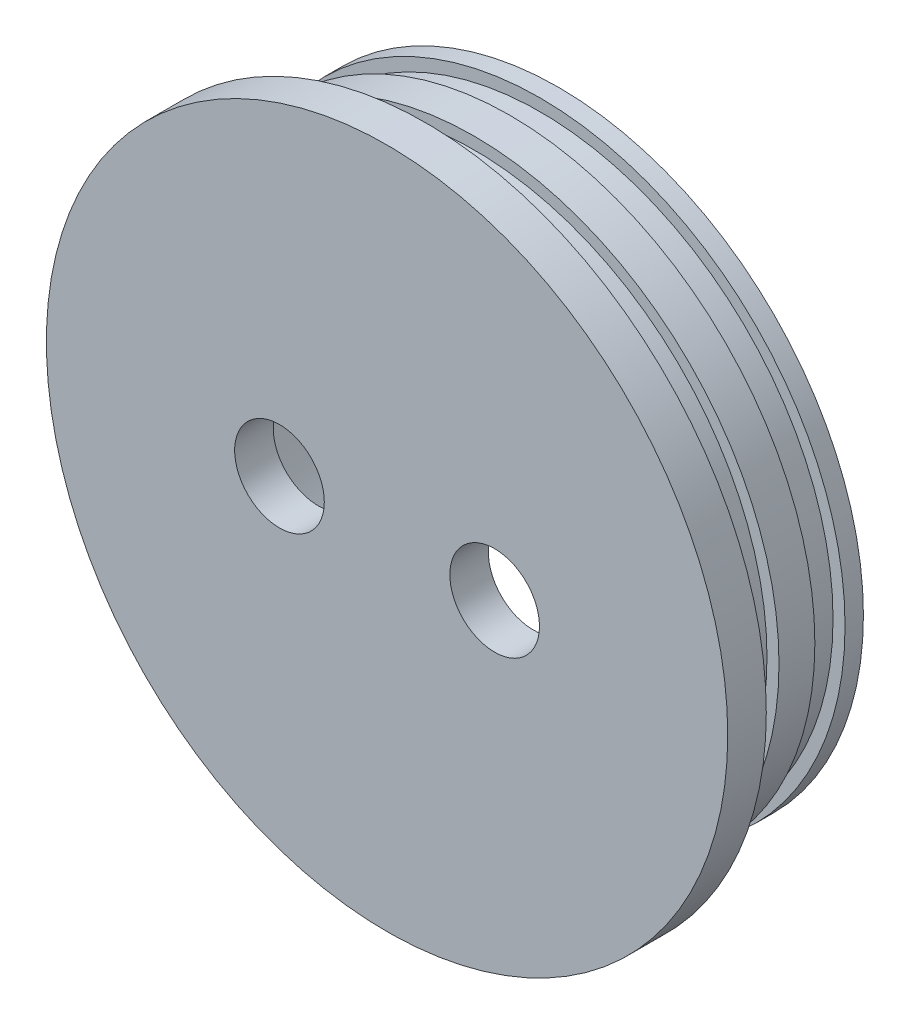
ISO-10303-21;
HEADER;
FILE_DESCRIPTION(('STEP AP214'),'2;1');
FILE_NAME('part.step','',(''),(''),'','','');
FILE_SCHEMA(('AUTOMOTIVE_DESIGN { 1 0 10303 214 1 1 1 1 }'));
ENDSEC;
DATA;
#1=APPLICATION_CONTEXT('core data for automotive mechanical design processes');
#2=APPLICATION_PROTOCOL_DEFINITION('international standard','automotive_design',2000,#1);
#3=PRODUCT_CONTEXT('',#1,'mechanical');
#4=PRODUCT('Part','Part','',(#3));
#5=PRODUCT_RELATED_PRODUCT_CATEGORY('part','',(#4));
#6=PRODUCT_DEFINITION_FORMATION('','',#4);
#7=PRODUCT_DEFINITION_CONTEXT('part definition',#1,'design');
#8=PRODUCT_DEFINITION('design','',#6,#7);
#9=PRODUCT_DEFINITION_SHAPE('','',#8);
#10=(LENGTH_UNIT() NAMED_UNIT(*) SI_UNIT(.MILLI.,.METRE.));
#11=(NAMED_UNIT(*) PLANE_ANGLE_UNIT() SI_UNIT($,.RADIAN.));
#12=(NAMED_UNIT(*) SI_UNIT($,.STERADIAN.) SOLID_ANGLE_UNIT());
#13=UNCERTAINTY_MEASURE_WITH_UNIT(LENGTH_MEASURE(1.E-05),#10,'distance_accuracy_value','');
#14=(GEOMETRIC_REPRESENTATION_CONTEXT(3) GLOBAL_UNCERTAINTY_ASSIGNED_CONTEXT((#13)) GLOBAL_UNIT_ASSIGNED_CONTEXT((#10,
#11,#12)) REPRESENTATION_CONTEXT('',''));
#15=CARTESIAN_POINT('',(0.,0.,0.));
#16=DIRECTION('',(0.,0.,1.));
#17=DIRECTION('',(1.,0.,0.));
#18=AXIS2_PLACEMENT_3D('',#15,#16,#17);
#19=CARTESIAN_POINT('',(0.,-51.,6.45));
#20=DIRECTION('',(0.,0.,-1.));
#21=DIRECTION('',(-1.,0.,0.));
#22=AXIS2_PLACEMENT_3D('',#19,#20,#21);
#23=PLANE('',#22);
#24=CARTESIAN_POINT('',(18.,-51.,6.45));
#25=DIRECTION('',(0.,0.,1.));
#26=DIRECTION('',(1.,0.,0.));
#27=AXIS2_PLACEMENT_3D('',#24,#25,#26);
#28=CIRCLE('',#27,7.5);
#29=CARTESIAN_POINT('',(25.5,-51.,6.45));
#30=VERTEX_POINT('',#29);
#31=EDGE_CURVE('E59',#30,#30,#28,.T.);
#32=ORIENTED_EDGE('',*,*,#31,.F.);
#33=EDGE_LOOP('',(#32));
#34=FACE_BOUND('',#33,.T.);
#35=CARTESIAN_POINT('',(-18.,-51.,6.45));
#36=DIRECTION('',(0.,0.,1.));
#37=DIRECTION('',(1.,0.,0.));
#38=AXIS2_PLACEMENT_3D('',#35,#36,#37);
#39=CIRCLE('',#38,7.5);
#40=CARTESIAN_POINT('',(-10.5,-51.,6.45));
#41=VERTEX_POINT('',#40);
#42=EDGE_CURVE('E67',#41,#41,#39,.T.);
#43=ORIENTED_EDGE('',*,*,#42,.F.);
#44=EDGE_LOOP('',(#43));
#45=FACE_BOUND('',#44,.T.);
#46=CARTESIAN_POINT('',(0.,-51.,6.45));
#47=DIRECTION('',(0.,0.,1.));
#48=DIRECTION('',(1.,0.,0.));
#49=AXIS2_PLACEMENT_3D('',#46,#47,#48);
#50=CIRCLE('',#49,57.);
#51=CARTESIAN_POINT('',(57.,-51.,6.45));
#52=VERTEX_POINT('',#51);
#53=EDGE_CURVE('E10',#52,#52,#50,.T.);
#54=ORIENTED_EDGE('',*,*,#53,.T.);
#55=EDGE_LOOP('',(#54));
#56=FACE_BOUND('',#55,.T.);
#57=ADVANCED_FACE('F39',(#34,#45,#56),#23,.F.);
#58=CARTESIAN_POINT('',(0.,-51.,6.45));
#59=DIRECTION('',(0.,0.,1.));
#60=DIRECTION('',(1.,0.,0.));
#61=AXIS2_PLACEMENT_3D('',#58,#59,#60);
#62=CYLINDRICAL_SURFACE('',#61,57.);
#63=ORIENTED_EDGE('',*,*,#53,.F.);
#64=EDGE_LOOP('',(#63));
#65=FACE_BOUND('',#64,.T.);
#66=CARTESIAN_POINT('',(0.,-51.,0.));
#67=DIRECTION('',(0.,0.,1.));
#68=DIRECTION('',(1.,0.,0.));
#69=AXIS2_PLACEMENT_3D('',#66,#67,#68);
#70=CIRCLE('',#69,57.);
#71=CARTESIAN_POINT('',(57.,-51.,0.));
#72=VERTEX_POINT('',#71);
#73=EDGE_CURVE('E47',#72,#72,#70,.T.);
#74=ORIENTED_EDGE('',*,*,#73,.T.);
#75=EDGE_LOOP('',(#74));
#76=FACE_BOUND('',#75,.T.);
#77=ADVANCED_FACE('F201',(#65,#76),#62,.T.);
#78=CARTESIAN_POINT('',(0.,6.,0.));
#79=DIRECTION('',(0.,0.,1.));
#80=DIRECTION('',(1.,0.,0.));
#81=AXIS2_PLACEMENT_3D('',#78,#79,#80);
#82=PLANE('',#81);
#83=ORIENTED_EDGE('',*,*,#73,.F.);
#84=EDGE_LOOP('',(#83));
#85=FACE_BOUND('',#84,.T.);
#86=CARTESIAN_POINT('',(0.,-51.,0.));
#87=DIRECTION('',(0.,0.,1.));
#88=DIRECTION('',(1.,0.,0.));
#89=AXIS2_PLACEMENT_3D('',#86,#87,#88);
#90=CIRCLE('',#89,51.);
#91=CARTESIAN_POINT('',(51.,-51.,0.));
#92=VERTEX_POINT('',#91);
#93=EDGE_CURVE('E53',#92,#92,#90,.T.);
#94=ORIENTED_EDGE('',*,*,#93,.T.);
#95=EDGE_LOOP('',(#94));
#96=FACE_BOUND('',#95,.T.);
#97=ADVANCED_FACE('F121',(#85,#96),#82,.F.);
#98=CARTESIAN_POINT('',(0.,-51.,6.45));
#99=DIRECTION('',(0.,0.,1.));
#100=DIRECTION('',(1.,0.,0.));
#101=AXIS2_PLACEMENT_3D('',#98,#99,#100);
#102=CYLINDRICAL_SURFACE('',#101,51.);
#103=ORIENTED_EDGE('',*,*,#93,.F.);
#104=EDGE_LOOP('',(#103));
#105=FACE_BOUND('',#104,.T.);
#106=CARTESIAN_POINT('',(0.,-51.,-3.075));
#107=DIRECTION('',(0.,0.,1.));
#108=DIRECTION('',(1.,0.,0.));
#109=AXIS2_PLACEMENT_3D('',#106,#107,#108);
#110=CIRCLE('',#109,51.);
#111=CARTESIAN_POINT('',(51.,-51.,-3.075));
#112=VERTEX_POINT('',#111);
#113=EDGE_CURVE('E114',#112,#112,#110,.T.);
#114=ORIENTED_EDGE('',*,*,#113,.T.);
#115=EDGE_LOOP('',(#114));
#116=FACE_BOUND('',#115,.T.);
#117=ADVANCED_FACE('F123',(#105,#116),#102,.T.);
#118=CARTESIAN_POINT('',(0.,0.,-3.075));
#119=DIRECTION('',(0.,0.,1.));
#120=DIRECTION('',(1.,0.,0.));
#121=AXIS2_PLACEMENT_3D('',#118,#119,#120);
#122=PLANE('',#121);
#123=ORIENTED_EDGE('',*,*,#113,.F.);
#124=EDGE_LOOP('',(#123));
#125=FACE_BOUND('',#124,.T.);
#126=CARTESIAN_POINT('',(0.,-51.,-3.075));
#127=DIRECTION('',(0.,0.,1.));
#128=DIRECTION('',(1.,0.,0.));
#129=AXIS2_PLACEMENT_3D('',#126,#127,#128);
#130=CIRCLE('',#129,48.9906499017856);
#131=CARTESIAN_POINT('',(48.9906499017856,-51.,-3.075));
#132=VERTEX_POINT('',#131);
#133=EDGE_CURVE('E110',#132,#132,#130,.T.);
#134=ORIENTED_EDGE('',*,*,#133,.T.);
#135=EDGE_LOOP('',(#134));
#136=FACE_BOUND('',#135,.T.);
#137=ADVANCED_FACE('F126',(#125,#136),#122,.F.);
#138=CARTESIAN_POINT('',(0.,-51.,6.45));
#139=DIRECTION('',(0.,0.,1.));
#140=DIRECTION('',(1.,0.,0.));
#141=AXIS2_PLACEMENT_3D('',#138,#139,#140);
#142=CYLINDRICAL_SURFACE('',#141,48.9906499017856);
#143=ORIENTED_EDGE('',*,*,#133,.F.);
#144=EDGE_LOOP('',(#143));
#145=FACE_BOUND('',#144,.T.);
#146=CARTESIAN_POINT('',(0.,-51.,-8.125));
#147=DIRECTION('',(0.,0.,1.));
#148=DIRECTION('',(1.,0.,0.));
#149=AXIS2_PLACEMENT_3D('',#146,#147,#148);
#150=CIRCLE('',#149,48.9906499017856);
#151=CARTESIAN_POINT('',(48.9906499017856,-51.,-8.125));
#152=VERTEX_POINT('',#151);
#153=EDGE_CURVE('E106',#152,#152,#150,.T.);
#154=ORIENTED_EDGE('',*,*,#153,.T.);
#155=EDGE_LOOP('',(#154));
#156=FACE_BOUND('',#155,.T.);
#157=ADVANCED_FACE('F132',(#145,#156),#142,.T.);
#158=CARTESIAN_POINT('',(0.,0.,-8.125));
#159=DIRECTION('',(0.,0.,-1.));
#160=DIRECTION('',(-1.,0.,0.));
#161=AXIS2_PLACEMENT_3D('',#158,#159,#160);
#162=PLANE('',#161);
#163=ORIENTED_EDGE('',*,*,#153,.F.);
#164=EDGE_LOOP('',(#163));
#165=FACE_BOUND('',#164,.T.);
#166=CARTESIAN_POINT('',(0.,-51.,-8.125));
#167=DIRECTION('',(0.,0.,1.));
#168=DIRECTION('',(1.,0.,0.));
#169=AXIS2_PLACEMENT_3D('',#166,#167,#168);
#170=CIRCLE('',#169,51.);
#171=CARTESIAN_POINT('',(51.,-51.,-8.125));
#172=VERTEX_POINT('',#171);
#173=EDGE_CURVE('E102',#172,#172,#170,.T.);
#174=ORIENTED_EDGE('',*,*,#173,.T.);
#175=EDGE_LOOP('',(#174));
#176=FACE_BOUND('',#175,.T.);
#177=ADVANCED_FACE('F138',(#165,#176),#162,.F.);
#178=CARTESIAN_POINT('',(0.,-51.,6.45));
#179=DIRECTION('',(0.,0.,1.));
#180=DIRECTION('',(1.,0.,0.));
#181=AXIS2_PLACEMENT_3D('',#178,#179,#180);
#182=CYLINDRICAL_SURFACE('',#181,51.);
#183=ORIENTED_EDGE('',*,*,#173,.F.);
#184=EDGE_LOOP('',(#183));
#185=FACE_BOUND('',#184,.T.);
#186=CARTESIAN_POINT('',(0.,-51.,-14.125));
#187=DIRECTION('',(0.,0.,1.));
#188=DIRECTION('',(1.,0.,0.));
#189=AXIS2_PLACEMENT_3D('',#186,#187,#188);
#190=CIRCLE('',#189,51.);
#191=CARTESIAN_POINT('',(51.,-51.,-14.125));
#192=VERTEX_POINT('',#191);
#193=EDGE_CURVE('E98',#192,#192,#190,.T.);
#194=ORIENTED_EDGE('',*,*,#193,.T.);
#195=EDGE_LOOP('',(#194));
#196=FACE_BOUND('',#195,.T.);
#197=ADVANCED_FACE('F144',(#185,#196),#182,.T.);
#198=CARTESIAN_POINT('',(0.,0.,-14.125));
#199=DIRECTION('',(0.,0.,1.));
#200=DIRECTION('',(1.,0.,0.));
#201=AXIS2_PLACEMENT_3D('',#198,#199,#200);
#202=PLANE('',#201);
#203=ORIENTED_EDGE('',*,*,#193,.F.);
#204=EDGE_LOOP('',(#203));
#205=FACE_BOUND('',#204,.T.);
#206=CARTESIAN_POINT('',(0.,-51.,-14.125));
#207=DIRECTION('',(0.,0.,1.));
#208=DIRECTION('',(1.,0.,0.));
#209=AXIS2_PLACEMENT_3D('',#206,#207,#208);
#210=CIRCLE('',#209,48.9906499017856);
#211=CARTESIAN_POINT('',(48.9906499017856,-51.,-14.125));
#212=VERTEX_POINT('',#211);
#213=EDGE_CURVE('E94',#212,#212,#210,.T.);
#214=ORIENTED_EDGE('',*,*,#213,.T.);
#215=EDGE_LOOP('',(#214));
#216=FACE_BOUND('',#215,.T.);
#217=ADVANCED_FACE('F150',(#205,#216),#202,.F.);
#218=CARTESIAN_POINT('',(0.,-51.,6.45));
#219=DIRECTION('',(0.,0.,1.));
#220=DIRECTION('',(1.,0.,0.));
#221=AXIS2_PLACEMENT_3D('',#218,#219,#220);
#222=CYLINDRICAL_SURFACE('',#221,48.9906499017856);
#223=ORIENTED_EDGE('',*,*,#213,.F.);
#224=EDGE_LOOP('',(#223));
#225=FACE_BOUND('',#224,.T.);
#226=CARTESIAN_POINT('',(0.,-51.,-19.175));
#227=DIRECTION('',(0.,0.,1.));
#228=DIRECTION('',(1.,0.,0.));
#229=AXIS2_PLACEMENT_3D('',#226,#227,#228);
#230=CIRCLE('',#229,48.9906499017856);
#231=CARTESIAN_POINT('',(48.9906499017856,-51.,-19.175));
#232=VERTEX_POINT('',#231);
#233=EDGE_CURVE('E90',#232,#232,#230,.T.);
#234=ORIENTED_EDGE('',*,*,#233,.T.);
#235=EDGE_LOOP('',(#234));
#236=FACE_BOUND('',#235,.T.);
#237=ADVANCED_FACE('F156',(#225,#236),#222,.T.);
#238=CARTESIAN_POINT('',(0.,0.,-19.175));
#239=DIRECTION('',(0.,0.,-1.));
#240=DIRECTION('',(-1.,0.,0.));
#241=AXIS2_PLACEMENT_3D('',#238,#239,#240);
#242=PLANE('',#241);
#243=ORIENTED_EDGE('',*,*,#233,.F.);
#244=EDGE_LOOP('',(#243));
#245=FACE_BOUND('',#244,.T.);
#246=CARTESIAN_POINT('',(0.,-51.,-19.175));
#247=DIRECTION('',(0.,0.,1.));
#248=DIRECTION('',(1.,0.,0.));
#249=AXIS2_PLACEMENT_3D('',#246,#247,#248);
#250=CIRCLE('',#249,51.);
#251=CARTESIAN_POINT('',(51.,-51.,-19.175));
#252=VERTEX_POINT('',#251);
#253=EDGE_CURVE('E86',#252,#252,#250,.T.);
#254=ORIENTED_EDGE('',*,*,#253,.T.);
#255=EDGE_LOOP('',(#254));
#256=FACE_BOUND('',#255,.T.);
#257=ADVANCED_FACE('F162',(#245,#256),#242,.F.);
#258=CARTESIAN_POINT('',(0.,-51.,6.45));
#259=DIRECTION('',(0.,0.,1.));
#260=DIRECTION('',(1.,0.,0.));
#261=AXIS2_PLACEMENT_3D('',#258,#259,#260);
#262=CYLINDRICAL_SURFACE('',#261,51.);
#263=ORIENTED_EDGE('',*,*,#253,.F.);
#264=EDGE_LOOP('',(#263));
#265=FACE_BOUND('',#264,.T.);
#266=CARTESIAN_POINT('',(0.,-51.,-22.25));
#267=DIRECTION('',(0.,0.,1.));
#268=DIRECTION('',(1.,0.,0.));
#269=AXIS2_PLACEMENT_3D('',#266,#267,#268);
#270=CIRCLE('',#269,51.);
#271=CARTESIAN_POINT('',(51.,-51.,-22.25));
#272=VERTEX_POINT('',#271);
#273=EDGE_CURVE('E82',#272,#272,#270,.T.);
#274=ORIENTED_EDGE('',*,*,#273,.T.);
#275=EDGE_LOOP('',(#274));
#276=FACE_BOUND('',#275,.T.);
#277=ADVANCED_FACE('F168',(#265,#276),#262,.T.);
#278=CARTESIAN_POINT('',(0.,0.,-22.25));
#279=DIRECTION('',(0.,0.,1.));
#280=DIRECTION('',(1.,0.,0.));
#281=AXIS2_PLACEMENT_3D('',#278,#279,#280);
#282=PLANE('',#281);
#283=ORIENTED_EDGE('',*,*,#273,.F.);
#284=EDGE_LOOP('',(#283));
#285=FACE_BOUND('',#284,.T.);
#286=CARTESIAN_POINT('',(0.,-51.,-22.25));
#287=DIRECTION('',(0.,0.,1.));
#288=DIRECTION('',(1.,0.,0.));
#289=AXIS2_PLACEMENT_3D('',#286,#287,#288);
#290=CIRCLE('',#289,43.4);
#291=CARTESIAN_POINT('',(43.4,-51.,-22.25));
#292=VERTEX_POINT('',#291);
#293=EDGE_CURVE('E78',#292,#292,#290,.T.);
#294=ORIENTED_EDGE('',*,*,#293,.T.);
#295=EDGE_LOOP('',(#294));
#296=FACE_BOUND('',#295,.T.);
#297=ADVANCED_FACE('F174',(#285,#296),#282,.F.);
#298=CARTESIAN_POINT('',(0.,-51.,6.45));
#299=DIRECTION('',(0.,0.,1.));
#300=DIRECTION('',(1.,0.,0.));
#301=AXIS2_PLACEMENT_3D('',#298,#299,#300);
#302=CYLINDRICAL_SURFACE('',#301,43.4);
#303=ORIENTED_EDGE('',*,*,#293,.F.);
#304=EDGE_LOOP('',(#303));
#305=FACE_BOUND('',#304,.T.);
#306=CARTESIAN_POINT('',(0.,-51.,0.));
#307=DIRECTION('',(0.,0.,1.));
#308=DIRECTION('',(1.,0.,0.));
#309=AXIS2_PLACEMENT_3D('',#306,#307,#308);
#310=CIRCLE('',#309,43.4);
#311=CARTESIAN_POINT('',(43.4,-51.,0.));
#312=VERTEX_POINT('',#311);
#313=EDGE_CURVE('E65',#312,#312,#310,.T.);
#314=ORIENTED_EDGE('',*,*,#313,.T.);
#315=EDGE_LOOP('',(#314));
#316=FACE_BOUND('',#315,.T.);
#317=ADVANCED_FACE('F180',(#305,#316),#302,.F.);
#318=CARTESIAN_POINT('',(0.,-7.6,0.));
#319=DIRECTION('',(0.,0.,1.));
#320=DIRECTION('',(1.,0.,0.));
#321=AXIS2_PLACEMENT_3D('',#318,#319,#320);
#322=PLANE('',#321);
#323=CARTESIAN_POINT('',(18.,-51.,0.));
#324=DIRECTION('',(0.,0.,1.));
#325=DIRECTION('',(1.,0.,0.));
#326=AXIS2_PLACEMENT_3D('',#323,#324,#325);
#327=CIRCLE('',#326,7.5);
#328=CARTESIAN_POINT('',(25.5,-51.,0.));
#329=VERTEX_POINT('',#328);
#330=EDGE_CURVE('E42',#329,#329,#327,.T.);
#331=ORIENTED_EDGE('',*,*,#330,.T.);
#332=EDGE_LOOP('',(#331));
#333=FACE_BOUND('',#332,.T.);
#334=CARTESIAN_POINT('',(-18.,-51.,0.));
#335=DIRECTION('',(0.,0.,1.));
#336=DIRECTION('',(1.,0.,0.));
#337=AXIS2_PLACEMENT_3D('',#334,#335,#336);
#338=CIRCLE('',#337,7.5);
#339=CARTESIAN_POINT('',(-10.5,-51.,0.));
#340=VERTEX_POINT('',#339);
#341=EDGE_CURVE('E56',#340,#340,#338,.T.);
#342=ORIENTED_EDGE('',*,*,#341,.T.);
#343=EDGE_LOOP('',(#342));
#344=FACE_BOUND('',#343,.T.);
#345=ORIENTED_EDGE('',*,*,#313,.F.);
#346=EDGE_LOOP('',(#345));
#347=FACE_BOUND('',#346,.T.);
#348=ADVANCED_FACE('F186',(#333,#344,#347),#322,.F.);
#349=CARTESIAN_POINT('',(-18.,-51.,-22.25));
#350=DIRECTION('',(0.,0.,1.));
#351=DIRECTION('',(1.,0.,0.));
#352=AXIS2_PLACEMENT_3D('',#349,#350,#351);
#353=CYLINDRICAL_SURFACE('',#352,7.5);
#354=ORIENTED_EDGE('',*,*,#42,.T.);
#355=EDGE_LOOP('',(#354));
#356=FACE_BOUND('',#355,.T.);
#357=ORIENTED_EDGE('',*,*,#341,.F.);
#358=EDGE_LOOP('',(#357));
#359=FACE_BOUND('',#358,.T.);
#360=ADVANCED_FACE('F191',(#356,#359),#353,.F.);
#361=CARTESIAN_POINT('',(18.,-51.,-22.25));
#362=DIRECTION('',(0.,0.,1.));
#363=DIRECTION('',(1.,0.,0.));
#364=AXIS2_PLACEMENT_3D('',#361,#362,#363);
#365=CYLINDRICAL_SURFACE('',#364,7.5);
#366=ORIENTED_EDGE('',*,*,#31,.T.);
#367=EDGE_LOOP('',(#366));
#368=FACE_BOUND('',#367,.T.);
#369=ORIENTED_EDGE('',*,*,#330,.F.);
#370=EDGE_LOOP('',(#369));
#371=FACE_BOUND('',#370,.T.);
#372=ADVANCED_FACE('F197',(#368,#371),#365,.F.);
#373=CLOSED_SHELL('',(#57,#77,#97,#117,#137,#157,#177,#197,#217,#237,#257,#277,#297,#317,#348,
#360,#372));
#374=MANIFOLD_SOLID_BREP('B2',#373);
#375=ADVANCED_BREP_SHAPE_REPRESENTATION('',(#18,#374),#14);
#376=SHAPE_DEFINITION_REPRESENTATION(#9,#375);
ENDSEC;
END-ISO-10303-21;
